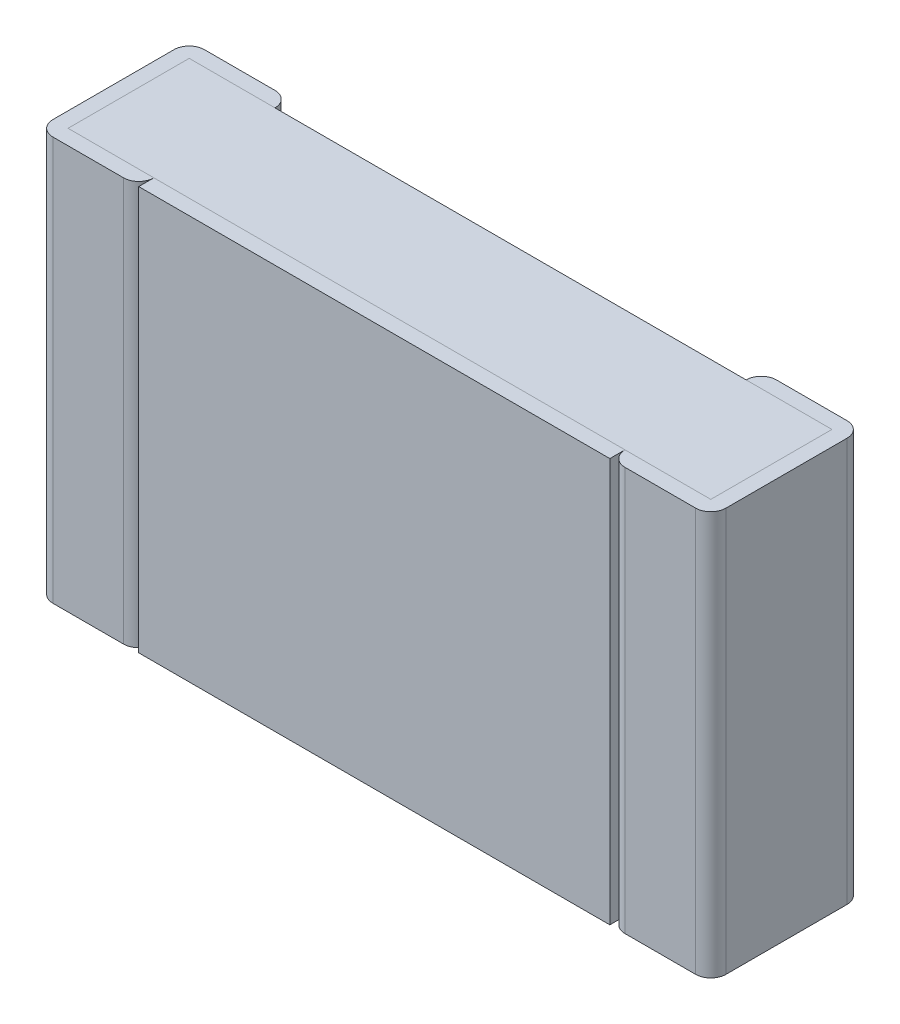
ISO-10303-21;
HEADER;
FILE_DESCRIPTION(('STEP AP214'),'2;1');
FILE_NAME('part.step','',(''),(''),'','','');
FILE_SCHEMA(('AUTOMOTIVE_DESIGN { 1 0 10303 214 1 1 1 1 }'));
ENDSEC;
DATA;
#1=APPLICATION_CONTEXT('core data for automotive mechanical design processes');
#2=APPLICATION_PROTOCOL_DEFINITION('international standard','automotive_design',2000,#1);
#3=PRODUCT_CONTEXT('',#1,'mechanical');
#4=PRODUCT('Part','Part','',(#3));
#5=PRODUCT_RELATED_PRODUCT_CATEGORY('part','',(#4));
#6=PRODUCT_DEFINITION_FORMATION('','',#4);
#7=PRODUCT_DEFINITION_CONTEXT('part definition',#1,'design');
#8=PRODUCT_DEFINITION('design','',#6,#7);
#9=PRODUCT_DEFINITION_SHAPE('','',#8);
#10=(LENGTH_UNIT() NAMED_UNIT(*) SI_UNIT(.MILLI.,.METRE.));
#11=(NAMED_UNIT(*) PLANE_ANGLE_UNIT() SI_UNIT($,.RADIAN.));
#12=(NAMED_UNIT(*) SI_UNIT($,.STERADIAN.) SOLID_ANGLE_UNIT());
#13=UNCERTAINTY_MEASURE_WITH_UNIT(LENGTH_MEASURE(1.E-05),#10,'distance_accuracy_value','');
#14=(GEOMETRIC_REPRESENTATION_CONTEXT(3) GLOBAL_UNCERTAINTY_ASSIGNED_CONTEXT((#13)) GLOBAL_UNIT_ASSIGNED_CONTEXT((#10,
#11,#12)) REPRESENTATION_CONTEXT('',''));
#15=CARTESIAN_POINT('',(0.,0.,0.));
#16=DIRECTION('',(0.,0.,1.));
#17=DIRECTION('',(1.,0.,0.));
#18=AXIS2_PLACEMENT_3D('',#15,#16,#17);
#19=CARTESIAN_POINT('',(-1.,-0.6,0.));
#20=DIRECTION('',(1.,0.,0.));
#21=DIRECTION('',(0.,1.,0.));
#22=AXIS2_PLACEMENT_3D('',#19,#20,#21);
#23=PLANE('',#22);
#24=DIRECTION('',(0.,1.,0.));
#25=VECTOR('',#24,1.);
#26=CARTESIAN_POINT('',(-1.,-0.6,0.405));
#27=LINE('',#26,#25);
#28=CARTESIAN_POINT('',(-1.,-0.6,0.405));
#29=VERTEX_POINT('',#28);
#30=CARTESIAN_POINT('',(-1.,0.6,0.405));
#31=VERTEX_POINT('',#30);
#32=EDGE_CURVE('E11',#29,#31,#27,.T.);
#33=ORIENTED_EDGE('',*,*,#32,.T.);
#34=DIRECTION('',(0.,0.,1.));
#35=VECTOR('',#34,1.);
#36=CARTESIAN_POINT('',(-1.,0.6,0.));
#37=LINE('',#36,#35);
#38=CARTESIAN_POINT('',(-1.,0.6,0.045));
#39=VERTEX_POINT('',#38);
#40=EDGE_CURVE('E41',#39,#31,#37,.T.);
#41=ORIENTED_EDGE('',*,*,#40,.F.);
#42=DIRECTION('',(0.,1.,0.));
#43=VECTOR('',#42,1.);
#44=CARTESIAN_POINT('',(-1.,-0.6,0.045));
#45=LINE('',#44,#43);
#46=CARTESIAN_POINT('',(-1.,-0.6,0.045));
#47=VERTEX_POINT('',#46);
#48=EDGE_CURVE('E331',#47,#39,#45,.T.);
#49=ORIENTED_EDGE('',*,*,#48,.F.);
#50=DIRECTION('',(0.,0.,1.));
#51=VECTOR('',#50,1.);
#52=CARTESIAN_POINT('',(-1.,-0.6,0.));
#53=LINE('',#52,#51);
#54=EDGE_CURVE('E27',#47,#29,#53,.T.);
#55=ORIENTED_EDGE('',*,*,#54,.T.);
#56=EDGE_LOOP('',(#33,#41,#49,#55));
#57=FACE_BOUND('',#56,.T.);
#58=ADVANCED_FACE('F16',(#57),#23,.F.);
#59=CARTESIAN_POINT('',(-1.,-0.6,0.));
#60=DIRECTION('',(0.,1.,0.));
#61=DIRECTION('',(1.,0.,0.));
#62=AXIS2_PLACEMENT_3D('',#59,#60,#61);
#63=PLANE('',#62);
#64=CARTESIAN_POINT('',(-0.745,-0.6,0.045));
#65=DIRECTION('',(0.,1.,0.));
#66=DIRECTION('',(0.,0.,1.));
#67=AXIS2_PLACEMENT_3D('',#64,#65,#66);
#68=CIRCLE('',#67,0.045);
#69=CARTESIAN_POINT('',(-0.7,-0.6,0.045));
#70=VERTEX_POINT('',#69);
#71=CARTESIAN_POINT('',(-0.745,-0.6,0.));
#72=VERTEX_POINT('',#71);
#73=EDGE_CURVE('E225',#70,#72,#68,.T.);
#74=ORIENTED_EDGE('',*,*,#73,.F.);
#75=DIRECTION('',(1.,0.,0.));
#76=VECTOR('',#75,1.);
#77=CARTESIAN_POINT('',(-0.955,-0.6,0.045));
#78=LINE('',#77,#76);
#79=CARTESIAN_POINT('',(-0.955,-0.6,0.045));
#80=VERTEX_POINT('',#79);
#81=EDGE_CURVE('E330',#80,#70,#78,.T.);
#82=ORIENTED_EDGE('',*,*,#81,.F.);
#83=DIRECTION('',(0.,0.,1.));
#84=VECTOR('',#83,1.);
#85=CARTESIAN_POINT('',(-0.955,-0.6,0.045));
#86=LINE('',#85,#84);
#87=CARTESIAN_POINT('',(-0.955,-0.6,0.405));
#88=VERTEX_POINT('',#87);
#89=EDGE_CURVE('E357',#80,#88,#86,.T.);
#90=ORIENTED_EDGE('',*,*,#89,.T.);
#91=DIRECTION('',(1.,0.,0.));
#92=VECTOR('',#91,1.);
#93=CARTESIAN_POINT('',(-0.955,-0.6,0.405));
#94=LINE('',#93,#92);
#95=CARTESIAN_POINT('',(-0.7,-0.6,0.405));
#96=VERTEX_POINT('',#95);
#97=EDGE_CURVE('E352',#88,#96,#94,.T.);
#98=ORIENTED_EDGE('',*,*,#97,.T.);
#99=CARTESIAN_POINT('',(-0.745,-0.6,0.405));
#100=DIRECTION('',(0.,-1.,0.));
#101=DIRECTION('',(0.,0.,1.));
#102=AXIS2_PLACEMENT_3D('',#99,#100,#101);
#103=CIRCLE('',#102,0.045);
#104=CARTESIAN_POINT('',(-0.745,-0.6,0.45));
#105=VERTEX_POINT('',#104);
#106=EDGE_CURVE('E348',#96,#105,#103,.T.);
#107=ORIENTED_EDGE('',*,*,#106,.T.);
#108=DIRECTION('',(1.,0.,0.));
#109=VECTOR('',#108,1.);
#110=CARTESIAN_POINT('',(-1.,-0.6,0.45));
#111=LINE('',#110,#109);
#112=CARTESIAN_POINT('',(-0.955,-0.6,0.45));
#113=VERTEX_POINT('',#112);
#114=EDGE_CURVE('E360',#113,#105,#111,.T.);
#115=ORIENTED_EDGE('',*,*,#114,.F.);
#116=CARTESIAN_POINT('',(-0.955,-0.6,0.405));
#117=DIRECTION('',(0.,1.,0.));
#118=DIRECTION('',(0.,0.,1.));
#119=AXIS2_PLACEMENT_3D('',#116,#117,#118);
#120=CIRCLE('',#119,0.045);
#121=EDGE_CURVE('E305',#29,#113,#120,.T.);
#122=ORIENTED_EDGE('',*,*,#121,.F.);
#123=ORIENTED_EDGE('',*,*,#54,.F.);
#124=CARTESIAN_POINT('',(-0.955,-0.6,0.045));
#125=DIRECTION('',(0.,-1.,0.));
#126=DIRECTION('',(0.,0.,1.));
#127=AXIS2_PLACEMENT_3D('',#124,#125,#126);
#128=CIRCLE('',#127,0.045);
#129=CARTESIAN_POINT('',(-0.955,-0.6,0.));
#130=VERTEX_POINT('',#129);
#131=EDGE_CURVE('E353',#47,#130,#128,.T.);
#132=ORIENTED_EDGE('',*,*,#131,.T.);
#133=DIRECTION('',(1.,0.,0.));
#134=VECTOR('',#133,1.);
#135=CARTESIAN_POINT('',(-1.,-0.6,0.));
#136=LINE('',#135,#134);
#137=EDGE_CURVE('E335',#130,#72,#136,.T.);
#138=ORIENTED_EDGE('',*,*,#137,.T.);
#139=EDGE_LOOP('',(#74,#82,#90,#98,#107,#115,#122,#123,#132,#138));
#140=FACE_BOUND('',#139,.T.);
#141=ADVANCED_FACE('F636',(#140),#63,.F.);
#142=CARTESIAN_POINT('',(-0.955,-0.6,0.045));
#143=DIRECTION('',(0.,1.,0.));
#144=DIRECTION('',(-1.,0.,0.));
#145=AXIS2_PLACEMENT_3D('',#142,#143,#144);
#146=CYLINDRICAL_SURFACE('',#145,0.045);
#147=ORIENTED_EDGE('',*,*,#48,.T.);
#148=CARTESIAN_POINT('',(-0.955,0.6,0.045));
#149=DIRECTION('',(0.,-1.,0.));
#150=DIRECTION('',(0.,0.,1.));
#151=AXIS2_PLACEMENT_3D('',#148,#149,#150);
#152=CIRCLE('',#151,0.045);
#153=CARTESIAN_POINT('',(-0.955,0.6,0.));
#154=VERTEX_POINT('',#153);
#155=EDGE_CURVE('E309',#39,#154,#152,.T.);
#156=ORIENTED_EDGE('',*,*,#155,.T.);
#157=DIRECTION('',(0.,1.,0.));
#158=VECTOR('',#157,1.);
#159=CARTESIAN_POINT('',(-0.955,-0.6,0.));
#160=LINE('',#159,#158);
#161=EDGE_CURVE('E222',#130,#154,#160,.T.);
#162=ORIENTED_EDGE('',*,*,#161,.F.);
#163=ORIENTED_EDGE('',*,*,#131,.F.);
#164=EDGE_LOOP('',(#147,#156,#162,#163));
#165=FACE_BOUND('',#164,.T.);
#166=ADVANCED_FACE('F618',(#165),#146,.T.);
#167=CARTESIAN_POINT('',(-0.955,-0.6,0.405));
#168=DIRECTION('',(0.,1.,0.));
#169=DIRECTION('',(-1.,0.,0.));
#170=AXIS2_PLACEMENT_3D('',#167,#168,#169);
#171=CYLINDRICAL_SURFACE('',#170,0.045);
#172=ORIENTED_EDGE('',*,*,#121,.T.);
#173=DIRECTION('',(0.,1.,0.));
#174=VECTOR('',#173,1.);
#175=CARTESIAN_POINT('',(-0.955,-0.6,0.45));
#176=LINE('',#175,#174);
#177=CARTESIAN_POINT('',(-0.955,0.6,0.45));
#178=VERTEX_POINT('',#177);
#179=EDGE_CURVE('E310',#113,#178,#176,.T.);
#180=ORIENTED_EDGE('',*,*,#179,.T.);
#181=CARTESIAN_POINT('',(-0.955,0.6,0.405));
#182=DIRECTION('',(0.,1.,0.));
#183=DIRECTION('',(0.,0.,1.));
#184=AXIS2_PLACEMENT_3D('',#181,#182,#183);
#185=CIRCLE('',#184,0.045);
#186=EDGE_CURVE('E364',#31,#178,#185,.T.);
#187=ORIENTED_EDGE('',*,*,#186,.F.);
#188=ORIENTED_EDGE('',*,*,#32,.F.);
#189=EDGE_LOOP('',(#172,#180,#187,#188));
#190=FACE_BOUND('',#189,.T.);
#191=ADVANCED_FACE('F540',(#190),#171,.T.);
#192=CARTESIAN_POINT('',(-1.,0.6,0.));
#193=DIRECTION('',(0.,1.,0.));
#194=DIRECTION('',(1.,0.,0.));
#195=AXIS2_PLACEMENT_3D('',#192,#193,#194);
#196=PLANE('',#195);
#197=DIRECTION('',(1.,0.,0.));
#198=VECTOR('',#197,1.);
#199=CARTESIAN_POINT('',(-1.,0.6,0.));
#200=LINE('',#199,#198);
#201=CARTESIAN_POINT('',(-0.745,0.6,0.));
#202=VERTEX_POINT('',#201);
#203=EDGE_CURVE('E216',#154,#202,#200,.T.);
#204=ORIENTED_EDGE('',*,*,#203,.F.);
#205=ORIENTED_EDGE('',*,*,#155,.F.);
#206=ORIENTED_EDGE('',*,*,#40,.T.);
#207=ORIENTED_EDGE('',*,*,#186,.T.);
#208=DIRECTION('',(1.,0.,0.));
#209=VECTOR('',#208,1.);
#210=CARTESIAN_POINT('',(-1.,0.6,0.45));
#211=LINE('',#210,#209);
#212=CARTESIAN_POINT('',(-0.745,0.6,0.45));
#213=VERTEX_POINT('',#212);
#214=EDGE_CURVE('E299',#178,#213,#211,.T.);
#215=ORIENTED_EDGE('',*,*,#214,.T.);
#216=CARTESIAN_POINT('',(-0.745,0.6,0.405));
#217=DIRECTION('',(0.,-1.,0.));
#218=DIRECTION('',(0.,0.,1.));
#219=AXIS2_PLACEMENT_3D('',#216,#217,#218);
#220=CIRCLE('',#219,0.045);
#221=CARTESIAN_POINT('',(-0.7,0.6,0.405));
#222=VERTEX_POINT('',#221);
#223=EDGE_CURVE('E392',#222,#213,#220,.T.);
#224=ORIENTED_EDGE('',*,*,#223,.F.);
#225=DIRECTION('',(1.,0.,0.));
#226=VECTOR('',#225,1.);
#227=CARTESIAN_POINT('',(-0.955,0.6,0.405));
#228=LINE('',#227,#226);
#229=CARTESIAN_POINT('',(-0.955,0.6,0.405));
#230=VERTEX_POINT('',#229);
#231=EDGE_CURVE('E323',#230,#222,#228,.T.);
#232=ORIENTED_EDGE('',*,*,#231,.F.);
#233=DIRECTION('',(0.,0.,1.));
#234=VECTOR('',#233,1.);
#235=CARTESIAN_POINT('',(-0.955,0.6,0.045));
#236=LINE('',#235,#234);
#237=CARTESIAN_POINT('',(-0.955,0.6,0.045));
#238=VERTEX_POINT('',#237);
#239=EDGE_CURVE('E326',#238,#230,#236,.T.);
#240=ORIENTED_EDGE('',*,*,#239,.F.);
#241=DIRECTION('',(1.,0.,0.));
#242=VECTOR('',#241,1.);
#243=CARTESIAN_POINT('',(-0.955,0.6,0.045));
#244=LINE('',#243,#242);
#245=CARTESIAN_POINT('',(-0.7,0.6,0.045));
#246=VERTEX_POINT('',#245);
#247=EDGE_CURVE('E232',#238,#246,#244,.T.);
#248=ORIENTED_EDGE('',*,*,#247,.T.);
#249=CARTESIAN_POINT('',(-0.745,0.6,0.045));
#250=DIRECTION('',(0.,1.,0.));
#251=DIRECTION('',(0.,0.,1.));
#252=AXIS2_PLACEMENT_3D('',#249,#250,#251);
#253=CIRCLE('',#252,0.045);
#254=EDGE_CURVE('E229',#246,#202,#253,.T.);
#255=ORIENTED_EDGE('',*,*,#254,.T.);
#256=EDGE_LOOP('',(#204,#205,#206,#207,#215,#224,#232,#240,#248,#255));
#257=FACE_BOUND('',#256,.T.);
#258=ADVANCED_FACE('F230',(#257),#196,.T.);
#259=CARTESIAN_POINT('',(-1.,-0.6,0.));
#260=DIRECTION('',(0.,0.,1.));
#261=DIRECTION('',(1.,0.,0.));
#262=AXIS2_PLACEMENT_3D('',#259,#260,#261);
#263=PLANE('',#262);
#264=DIRECTION('',(0.,1.,0.));
#265=VECTOR('',#264,1.);
#266=CARTESIAN_POINT('',(-0.745,-0.6,0.));
#267=LINE('',#266,#265);
#268=EDGE_CURVE('E220',#72,#202,#267,.T.);
#269=ORIENTED_EDGE('',*,*,#268,.F.);
#270=ORIENTED_EDGE('',*,*,#137,.F.);
#271=ORIENTED_EDGE('',*,*,#161,.T.);
#272=ORIENTED_EDGE('',*,*,#203,.T.);
#273=EDGE_LOOP('',(#269,#270,#271,#272));
#274=FACE_BOUND('',#273,.T.);
#275=ADVANCED_FACE('F218',(#274),#263,.F.);
#276=CARTESIAN_POINT('',(-0.745,-0.6,0.045));
#277=DIRECTION('',(0.,1.,0.));
#278=DIRECTION('',(1.,0.,0.));
#279=AXIS2_PLACEMENT_3D('',#276,#277,#278);
#280=CYLINDRICAL_SURFACE('',#279,0.045);
#281=ORIENTED_EDGE('',*,*,#73,.T.);
#282=ORIENTED_EDGE('',*,*,#268,.T.);
#283=ORIENTED_EDGE('',*,*,#254,.F.);
#284=DIRECTION('',(0.,1.,0.));
#285=VECTOR('',#284,1.);
#286=CARTESIAN_POINT('',(-0.7,-0.6,0.045));
#287=LINE('',#286,#285);
#288=EDGE_CURVE('E266',#70,#246,#287,.T.);
#289=ORIENTED_EDGE('',*,*,#288,.F.);
#290=EDGE_LOOP('',(#281,#282,#283,#289));
#291=FACE_BOUND('',#290,.T.);
#292=ADVANCED_FACE('F237',(#291),#280,.T.);
#293=CARTESIAN_POINT('',(-0.955,-0.6,0.045));
#294=DIRECTION('',(0.,1.,0.));
#295=DIRECTION('',(1.,0.,0.));
#296=AXIS2_PLACEMENT_3D('',#293,#294,#295);
#297=PLANE('',#296);
#298=DIRECTION('',(1.,0.,0.));
#299=VECTOR('',#298,1.);
#300=CARTESIAN_POINT('',(-0.955,-0.6,0.045));
#301=LINE('',#300,#299);
#302=CARTESIAN_POINT('',(0.7,-0.6,0.045));
#303=VERTEX_POINT('',#302);
#304=EDGE_CURVE('E241',#70,#303,#301,.T.);
#305=ORIENTED_EDGE('',*,*,#304,.T.);
#306=DIRECTION('',(1.,0.,0.));
#307=VECTOR('',#306,1.);
#308=CARTESIAN_POINT('',(-0.955,-0.6,0.045));
#309=LINE('',#308,#307);
#310=CARTESIAN_POINT('',(0.955,-0.6,0.045));
#311=VERTEX_POINT('',#310);
#312=EDGE_CURVE('E250',#303,#311,#309,.T.);
#313=ORIENTED_EDGE('',*,*,#312,.T.);
#314=DIRECTION('',(0.,0.,1.));
#315=VECTOR('',#314,1.);
#316=CARTESIAN_POINT('',(0.955,-0.6,0.045));
#317=LINE('',#316,#315);
#318=CARTESIAN_POINT('',(0.955,-0.6,0.405));
#319=VERTEX_POINT('',#318);
#320=EDGE_CURVE('E256',#311,#319,#317,.T.);
#321=ORIENTED_EDGE('',*,*,#320,.T.);
#322=DIRECTION('',(1.,0.,0.));
#323=VECTOR('',#322,1.);
#324=CARTESIAN_POINT('',(-0.955,-0.6,0.405));
#325=LINE('',#324,#323);
#326=CARTESIAN_POINT('',(0.7,-0.6,0.405));
#327=VERTEX_POINT('',#326);
#328=EDGE_CURVE('E296',#327,#319,#325,.T.);
#329=ORIENTED_EDGE('',*,*,#328,.F.);
#330=DIRECTION('',(1.,0.,0.));
#331=VECTOR('',#330,1.);
#332=CARTESIAN_POINT('',(-0.7,-0.6,0.405));
#333=LINE('',#332,#331);
#334=EDGE_CURVE('E346',#96,#327,#333,.T.);
#335=ORIENTED_EDGE('',*,*,#334,.F.);
#336=ORIENTED_EDGE('',*,*,#97,.F.);
#337=ORIENTED_EDGE('',*,*,#89,.F.);
#338=ORIENTED_EDGE('',*,*,#81,.T.);
#339=EDGE_LOOP('',(#305,#313,#321,#329,#335,#336,#337,#338));
#340=FACE_BOUND('',#339,.T.);
#341=ADVANCED_FACE('F568',(#340),#297,.F.);
#342=CARTESIAN_POINT('',(-1.,-0.6,0.45));
#343=DIRECTION('',(0.,0.,1.));
#344=DIRECTION('',(1.,0.,0.));
#345=AXIS2_PLACEMENT_3D('',#342,#343,#344);
#346=PLANE('',#345);
#347=ORIENTED_EDGE('',*,*,#214,.F.);
#348=ORIENTED_EDGE('',*,*,#179,.F.);
#349=ORIENTED_EDGE('',*,*,#114,.T.);
#350=DIRECTION('',(0.,1.,0.));
#351=VECTOR('',#350,1.);
#352=CARTESIAN_POINT('',(-0.745,-0.6,0.45));
#353=LINE('',#352,#351);
#354=EDGE_CURVE('E363',#105,#213,#353,.T.);
#355=ORIENTED_EDGE('',*,*,#354,.T.);
#356=EDGE_LOOP('',(#347,#348,#349,#355));
#357=FACE_BOUND('',#356,.T.);
#358=ADVANCED_FACE('F559',(#357),#346,.T.);
#359=CARTESIAN_POINT('',(-0.745,-0.6,0.405));
#360=DIRECTION('',(0.,1.,0.));
#361=DIRECTION('',(1.,0.,0.));
#362=AXIS2_PLACEMENT_3D('',#359,#360,#361);
#363=CYLINDRICAL_SURFACE('',#362,0.045);
#364=DIRECTION('',(0.,1.,0.));
#365=VECTOR('',#364,1.);
#366=CARTESIAN_POINT('',(-0.7,-0.6,0.405));
#367=LINE('',#366,#365);
#368=EDGE_CURVE('E381',#96,#222,#367,.T.);
#369=ORIENTED_EDGE('',*,*,#368,.T.);
#370=ORIENTED_EDGE('',*,*,#223,.T.);
#371=ORIENTED_EDGE('',*,*,#354,.F.);
#372=ORIENTED_EDGE('',*,*,#106,.F.);
#373=EDGE_LOOP('',(#369,#370,#371,#372));
#374=FACE_BOUND('',#373,.T.);
#375=ADVANCED_FACE('F555',(#374),#363,.T.);
#376=CARTESIAN_POINT('',(-0.955,0.6,0.045));
#377=DIRECTION('',(0.,1.,0.));
#378=DIRECTION('',(1.,0.,0.));
#379=AXIS2_PLACEMENT_3D('',#376,#377,#378);
#380=PLANE('',#379);
#381=ORIENTED_EDGE('',*,*,#247,.F.);
#382=ORIENTED_EDGE('',*,*,#239,.T.);
#383=ORIENTED_EDGE('',*,*,#231,.T.);
#384=DIRECTION('',(1.,0.,0.));
#385=VECTOR('',#384,1.);
#386=CARTESIAN_POINT('',(-0.7,0.6,0.405));
#387=LINE('',#386,#385);
#388=CARTESIAN_POINT('',(0.7,0.6,0.405));
#389=VERTEX_POINT('',#388);
#390=EDGE_CURVE('E277',#222,#389,#387,.T.);
#391=ORIENTED_EDGE('',*,*,#390,.T.);
#392=DIRECTION('',(1.,0.,0.));
#393=VECTOR('',#392,1.);
#394=CARTESIAN_POINT('',(-0.955,0.6,0.405));
#395=LINE('',#394,#393);
#396=CARTESIAN_POINT('',(0.955,0.6,0.405));
#397=VERTEX_POINT('',#396);
#398=EDGE_CURVE('E271',#389,#397,#395,.T.);
#399=ORIENTED_EDGE('',*,*,#398,.T.);
#400=DIRECTION('',(0.,0.,1.));
#401=VECTOR('',#400,1.);
#402=CARTESIAN_POINT('',(0.955,0.6,0.045));
#403=LINE('',#402,#401);
#404=CARTESIAN_POINT('',(0.955,0.6,0.045));
#405=VERTEX_POINT('',#404);
#406=EDGE_CURVE('E257',#405,#397,#403,.T.);
#407=ORIENTED_EDGE('',*,*,#406,.F.);
#408=DIRECTION('',(1.,0.,0.));
#409=VECTOR('',#408,1.);
#410=CARTESIAN_POINT('',(-0.955,0.6,0.045));
#411=LINE('',#410,#409);
#412=CARTESIAN_POINT('',(0.7,0.6,0.045));
#413=VERTEX_POINT('',#412);
#414=EDGE_CURVE('E261',#413,#405,#411,.T.);
#415=ORIENTED_EDGE('',*,*,#414,.F.);
#416=DIRECTION('',(1.,0.,0.));
#417=VECTOR('',#416,1.);
#418=CARTESIAN_POINT('',(-0.955,0.6,0.045));
#419=LINE('',#418,#417);
#420=EDGE_CURVE('E268',#246,#413,#419,.T.);
#421=ORIENTED_EDGE('',*,*,#420,.F.);
#422=EDGE_LOOP('',(#381,#382,#383,#391,#399,#407,#415,#421));
#423=FACE_BOUND('',#422,.T.);
#424=ADVANCED_FACE('F520',(#423),#380,.T.);
#425=CARTESIAN_POINT('',(-0.955,-0.6,0.045));
#426=DIRECTION('',(0.,0.,1.));
#427=DIRECTION('',(1.,0.,0.));
#428=AXIS2_PLACEMENT_3D('',#425,#426,#427);
#429=PLANE('',#428);
#430=ORIENTED_EDGE('',*,*,#420,.T.);
#431=DIRECTION('',(0.,1.,0.));
#432=VECTOR('',#431,1.);
#433=CARTESIAN_POINT('',(0.7,-0.6,0.045));
#434=LINE('',#433,#432);
#435=EDGE_CURVE('E386',#303,#413,#434,.T.);
#436=ORIENTED_EDGE('',*,*,#435,.F.);
#437=ORIENTED_EDGE('',*,*,#304,.F.);
#438=ORIENTED_EDGE('',*,*,#288,.T.);
#439=EDGE_LOOP('',(#430,#436,#437,#438));
#440=FACE_BOUND('',#439,.T.);
#441=ADVANCED_FACE('F509',(#440),#429,.F.);
#442=CARTESIAN_POINT('',(0.7,-0.6,0.));
#443=DIRECTION('',(0.,1.,0.));
#444=DIRECTION('',(1.,0.,0.));
#445=AXIS2_PLACEMENT_3D('',#442,#443,#444);
#446=PLANE('',#445);
#447=CARTESIAN_POINT('',(0.955,-0.6,0.045));
#448=DIRECTION('',(0.,1.,0.));
#449=DIRECTION('',(0.,0.,1.));
#450=AXIS2_PLACEMENT_3D('',#447,#448,#449);
#451=CIRCLE('',#450,0.045);
#452=CARTESIAN_POINT('',(1.,-0.6,0.045));
#453=VERTEX_POINT('',#452);
#454=CARTESIAN_POINT('',(0.955,-0.6,0.));
#455=VERTEX_POINT('',#454);
#456=EDGE_CURVE('E20',#453,#455,#451,.T.);
#457=ORIENTED_EDGE('',*,*,#456,.F.);
#458=DIRECTION('',(0.,0.,1.));
#459=VECTOR('',#458,1.);
#460=CARTESIAN_POINT('',(1.,-0.6,0.));
#461=LINE('',#460,#459);
#462=CARTESIAN_POINT('',(1.,-0.6,0.405));
#463=VERTEX_POINT('',#462);
#464=EDGE_CURVE('E263',#453,#463,#461,.T.);
#465=ORIENTED_EDGE('',*,*,#464,.T.);
#466=CARTESIAN_POINT('',(0.955,-0.6,0.405));
#467=DIRECTION('',(0.,-1.,0.));
#468=DIRECTION('',(0.,0.,1.));
#469=AXIS2_PLACEMENT_3D('',#466,#467,#468);
#470=CIRCLE('',#469,0.045);
#471=CARTESIAN_POINT('',(0.955,-0.6,0.45));
#472=VERTEX_POINT('',#471);
#473=EDGE_CURVE('E267',#463,#472,#470,.T.);
#474=ORIENTED_EDGE('',*,*,#473,.T.);
#475=DIRECTION('',(1.,0.,0.));
#476=VECTOR('',#475,1.);
#477=CARTESIAN_POINT('',(0.7,-0.6,0.45));
#478=LINE('',#477,#476);
#479=CARTESIAN_POINT('',(0.745,-0.6,0.45));
#480=VERTEX_POINT('',#479);
#481=EDGE_CURVE('E321',#480,#472,#478,.T.);
#482=ORIENTED_EDGE('',*,*,#481,.F.);
#483=CARTESIAN_POINT('',(0.745,-0.6,0.405));
#484=DIRECTION('',(0.,1.,0.));
#485=DIRECTION('',(0.,0.,1.));
#486=AXIS2_PLACEMENT_3D('',#483,#484,#485);
#487=CIRCLE('',#486,0.045);
#488=EDGE_CURVE('E322',#327,#480,#487,.T.);
#489=ORIENTED_EDGE('',*,*,#488,.F.);
#490=ORIENTED_EDGE('',*,*,#328,.T.);
#491=ORIENTED_EDGE('',*,*,#320,.F.);
#492=ORIENTED_EDGE('',*,*,#312,.F.);
#493=CARTESIAN_POINT('',(0.745,-0.6,0.045));
#494=DIRECTION('',(0.,-1.,0.));
#495=DIRECTION('',(0.,0.,1.));
#496=AXIS2_PLACEMENT_3D('',#493,#494,#495);
#497=CIRCLE('',#496,0.045);
#498=CARTESIAN_POINT('',(0.745,-0.6,0.));
#499=VERTEX_POINT('',#498);
#500=EDGE_CURVE('E300',#303,#499,#497,.T.);
#501=ORIENTED_EDGE('',*,*,#500,.T.);
#502=DIRECTION('',(1.,0.,0.));
#503=VECTOR('',#502,1.);
#504=CARTESIAN_POINT('',(0.7,-0.6,0.));
#505=LINE('',#504,#503);
#506=EDGE_CURVE('E304',#499,#455,#505,.T.);
#507=ORIENTED_EDGE('',*,*,#506,.T.);
#508=EDGE_LOOP('',(#457,#465,#474,#482,#489,#490,#491,#492,#501,#507));
#509=FACE_BOUND('',#508,.T.);
#510=ADVANCED_FACE('F18',(#509),#446,.F.);
#511=CARTESIAN_POINT('',(-0.7,-0.6,0.405));
#512=DIRECTION('',(0.,1.,0.));
#513=DIRECTION('',(1.,0.,0.));
#514=AXIS2_PLACEMENT_3D('',#511,#512,#513);
#515=PLANE('',#514);
#516=DIRECTION('',(0.,0.,1.));
#517=VECTOR('',#516,1.);
#518=CARTESIAN_POINT('',(0.7,-0.6,0.405));
#519=LINE('',#518,#517);
#520=CARTESIAN_POINT('',(0.7,-0.6,0.45));
#521=VERTEX_POINT('',#520);
#522=EDGE_CURVE('E405',#327,#521,#519,.T.);
#523=ORIENTED_EDGE('',*,*,#522,.T.);
#524=DIRECTION('',(1.,0.,0.));
#525=VECTOR('',#524,1.);
#526=CARTESIAN_POINT('',(-0.7,-0.6,0.45));
#527=LINE('',#526,#525);
#528=CARTESIAN_POINT('',(-0.7,-0.6,0.45));
#529=VERTEX_POINT('',#528);
#530=EDGE_CURVE('E287',#529,#521,#527,.T.);
#531=ORIENTED_EDGE('',*,*,#530,.F.);
#532=DIRECTION('',(0.,0.,1.));
#533=VECTOR('',#532,1.);
#534=CARTESIAN_POINT('',(-0.7,-0.6,0.405));
#535=LINE('',#534,#533);
#536=EDGE_CURVE('E347',#96,#529,#535,.T.);
#537=ORIENTED_EDGE('',*,*,#536,.F.);
#538=ORIENTED_EDGE('',*,*,#334,.T.);
#539=EDGE_LOOP('',(#523,#531,#537,#538));
#540=FACE_BOUND('',#539,.T.);
#541=ADVANCED_FACE('F508',(#540),#515,.F.);
#542=CARTESIAN_POINT('',(-0.7,-0.6,0.405));
#543=DIRECTION('',(1.,0.,0.));
#544=DIRECTION('',(0.,1.,0.));
#545=AXIS2_PLACEMENT_3D('',#542,#543,#544);
#546=PLANE('',#545);
#547=DIRECTION('',(0.,1.,0.));
#548=VECTOR('',#547,1.);
#549=CARTESIAN_POINT('',(-0.7,-0.6,0.45));
#550=LINE('',#549,#548);
#551=CARTESIAN_POINT('',(-0.7,0.6,0.45));
#552=VERTEX_POINT('',#551);
#553=EDGE_CURVE('E342',#529,#552,#550,.T.);
#554=ORIENTED_EDGE('',*,*,#553,.T.);
#555=DIRECTION('',(0.,0.,1.));
#556=VECTOR('',#555,1.);
#557=CARTESIAN_POINT('',(-0.7,0.6,0.405));
#558=LINE('',#557,#556);
#559=EDGE_CURVE('E289',#222,#552,#558,.T.);
#560=ORIENTED_EDGE('',*,*,#559,.F.);
#561=ORIENTED_EDGE('',*,*,#368,.F.);
#562=ORIENTED_EDGE('',*,*,#536,.T.);
#563=EDGE_LOOP('',(#554,#560,#561,#562));
#564=FACE_BOUND('',#563,.T.);
#565=ADVANCED_FACE('F549',(#564),#546,.F.);
#566=CARTESIAN_POINT('',(0.7,0.6,0.));
#567=DIRECTION('',(0.,1.,0.));
#568=DIRECTION('',(1.,0.,0.));
#569=AXIS2_PLACEMENT_3D('',#566,#567,#568);
#570=PLANE('',#569);
#571=DIRECTION('',(1.,0.,0.));
#572=VECTOR('',#571,1.);
#573=CARTESIAN_POINT('',(0.7,0.6,0.));
#574=LINE('',#573,#572);
#575=CARTESIAN_POINT('',(0.745,0.6,0.));
#576=VERTEX_POINT('',#575);
#577=CARTESIAN_POINT('',(0.955,0.6,0.));
#578=VERTEX_POINT('',#577);
#579=EDGE_CURVE('E112',#576,#578,#574,.T.);
#580=ORIENTED_EDGE('',*,*,#579,.F.);
#581=CARTESIAN_POINT('',(0.745,0.6,0.045));
#582=DIRECTION('',(0.,-1.,0.));
#583=DIRECTION('',(0.,0.,1.));
#584=AXIS2_PLACEMENT_3D('',#581,#582,#583);
#585=CIRCLE('',#584,0.045);
#586=EDGE_CURVE('E374',#413,#576,#585,.T.);
#587=ORIENTED_EDGE('',*,*,#586,.F.);
#588=ORIENTED_EDGE('',*,*,#414,.T.);
#589=ORIENTED_EDGE('',*,*,#406,.T.);
#590=ORIENTED_EDGE('',*,*,#398,.F.);
#591=CARTESIAN_POINT('',(0.745,0.6,0.405));
#592=DIRECTION('',(0.,1.,0.));
#593=DIRECTION('',(0.,0.,1.));
#594=AXIS2_PLACEMENT_3D('',#591,#592,#593);
#595=CIRCLE('',#594,0.045);
#596=CARTESIAN_POINT('',(0.745,0.6,0.45));
#597=VERTEX_POINT('',#596);
#598=EDGE_CURVE('E262',#389,#597,#595,.T.);
#599=ORIENTED_EDGE('',*,*,#598,.T.);
#600=DIRECTION('',(1.,0.,0.));
#601=VECTOR('',#600,1.);
#602=CARTESIAN_POINT('',(0.7,0.6,0.45));
#603=LINE('',#602,#601);
#604=CARTESIAN_POINT('',(0.955,0.6,0.45));
#605=VERTEX_POINT('',#604);
#606=EDGE_CURVE('E396',#597,#605,#603,.T.);
#607=ORIENTED_EDGE('',*,*,#606,.T.);
#608=CARTESIAN_POINT('',(0.955,0.6,0.405));
#609=DIRECTION('',(0.,-1.,0.));
#610=DIRECTION('',(0.,0.,1.));
#611=AXIS2_PLACEMENT_3D('',#608,#609,#610);
#612=CIRCLE('',#611,0.045);
#613=CARTESIAN_POINT('',(1.,0.6,0.405));
#614=VERTEX_POINT('',#613);
#615=EDGE_CURVE('E316',#614,#605,#612,.T.);
#616=ORIENTED_EDGE('',*,*,#615,.F.);
#617=DIRECTION('',(0.,0.,1.));
#618=VECTOR('',#617,1.);
#619=CARTESIAN_POINT('',(1.,0.6,0.));
#620=LINE('',#619,#618);
#621=CARTESIAN_POINT('',(1.,0.6,0.045));
#622=VERTEX_POINT('',#621);
#623=EDGE_CURVE('E315',#622,#614,#620,.T.);
#624=ORIENTED_EDGE('',*,*,#623,.F.);
#625=CARTESIAN_POINT('',(0.955,0.6,0.045));
#626=DIRECTION('',(0.,1.,0.));
#627=DIRECTION('',(0.,0.,1.));
#628=AXIS2_PLACEMENT_3D('',#625,#626,#627);
#629=CIRCLE('',#628,0.045);
#630=EDGE_CURVE('E291',#622,#578,#629,.T.);
#631=ORIENTED_EDGE('',*,*,#630,.T.);
#632=EDGE_LOOP('',(#580,#587,#588,#589,#590,#599,#607,#616,#624,#631));
#633=FACE_BOUND('',#632,.T.);
#634=ADVANCED_FACE('F493',(#633),#570,.T.);
#635=CARTESIAN_POINT('',(-0.7,0.6,0.405));
#636=DIRECTION('',(0.,1.,0.));
#637=DIRECTION('',(1.,0.,0.));
#638=AXIS2_PLACEMENT_3D('',#635,#636,#637);
#639=PLANE('',#638);
#640=ORIENTED_EDGE('',*,*,#390,.F.);
#641=ORIENTED_EDGE('',*,*,#559,.T.);
#642=DIRECTION('',(1.,0.,0.));
#643=VECTOR('',#642,1.);
#644=CARTESIAN_POINT('',(-0.7,0.6,0.45));
#645=LINE('',#644,#643);
#646=CARTESIAN_POINT('',(0.7,0.6,0.45));
#647=VERTEX_POINT('',#646);
#648=EDGE_CURVE('E292',#552,#647,#645,.T.);
#649=ORIENTED_EDGE('',*,*,#648,.T.);
#650=DIRECTION('',(0.,0.,1.));
#651=VECTOR('',#650,1.);
#652=CARTESIAN_POINT('',(0.7,0.6,0.405));
#653=LINE('',#652,#651);
#654=EDGE_CURVE('E128',#389,#647,#653,.T.);
#655=ORIENTED_EDGE('',*,*,#654,.F.);
#656=EDGE_LOOP('',(#640,#641,#649,#655));
#657=FACE_BOUND('',#656,.T.);
#658=ADVANCED_FACE('F531',(#657),#639,.T.);
#659=CARTESIAN_POINT('',(0.745,-0.6,0.045));
#660=DIRECTION('',(0.,1.,0.));
#661=DIRECTION('',(-1.,0.,0.));
#662=AXIS2_PLACEMENT_3D('',#659,#660,#661);
#663=CYLINDRICAL_SURFACE('',#662,0.045);
#664=ORIENTED_EDGE('',*,*,#435,.T.);
#665=ORIENTED_EDGE('',*,*,#586,.T.);
#666=DIRECTION('',(0.,1.,0.));
#667=VECTOR('',#666,1.);
#668=CARTESIAN_POINT('',(0.745,-0.6,0.));
#669=LINE('',#668,#667);
#670=EDGE_CURVE('E371',#499,#576,#669,.T.);
#671=ORIENTED_EDGE('',*,*,#670,.F.);
#672=ORIENTED_EDGE('',*,*,#500,.F.);
#673=EDGE_LOOP('',(#664,#665,#671,#672));
#674=FACE_BOUND('',#673,.T.);
#675=ADVANCED_FACE('F526',(#674),#663,.T.);
#676=CARTESIAN_POINT('',(0.7,-0.6,0.));
#677=DIRECTION('',(0.,0.,1.));
#678=DIRECTION('',(1.,0.,0.));
#679=AXIS2_PLACEMENT_3D('',#676,#677,#678);
#680=PLANE('',#679);
#681=DIRECTION('',(0.,1.,0.));
#682=VECTOR('',#681,1.);
#683=CARTESIAN_POINT('',(0.955,-0.6,0.));
#684=LINE('',#683,#682);
#685=EDGE_CURVE('E407',#455,#578,#684,.T.);
#686=ORIENTED_EDGE('',*,*,#685,.F.);
#687=ORIENTED_EDGE('',*,*,#506,.F.);
#688=ORIENTED_EDGE('',*,*,#670,.T.);
#689=ORIENTED_EDGE('',*,*,#579,.T.);
#690=EDGE_LOOP('',(#686,#687,#688,#689));
#691=FACE_BOUND('',#690,.T.);
#692=ADVANCED_FACE('F530',(#691),#680,.F.);
#693=CARTESIAN_POINT('',(0.955,-0.6,0.045));
#694=DIRECTION('',(0.,1.,0.));
#695=DIRECTION('',(1.,0.,0.));
#696=AXIS2_PLACEMENT_3D('',#693,#694,#695);
#697=CYLINDRICAL_SURFACE('',#696,0.045);
#698=ORIENTED_EDGE('',*,*,#456,.T.);
#699=ORIENTED_EDGE('',*,*,#685,.T.);
#700=ORIENTED_EDGE('',*,*,#630,.F.);
#701=DIRECTION('',(0.,1.,0.));
#702=VECTOR('',#701,1.);
#703=CARTESIAN_POINT('',(1.,-0.6,0.045));
#704=LINE('',#703,#702);
#705=EDGE_CURVE('E411',#453,#622,#704,.T.);
#706=ORIENTED_EDGE('',*,*,#705,.F.);
#707=EDGE_LOOP('',(#698,#699,#700,#706));
#708=FACE_BOUND('',#707,.T.);
#709=ADVANCED_FACE('F491',(#708),#697,.T.);
#710=CARTESIAN_POINT('',(1.,-0.6,0.));
#711=DIRECTION('',(1.,0.,0.));
#712=DIRECTION('',(0.,1.,0.));
#713=AXIS2_PLACEMENT_3D('',#710,#711,#712);
#714=PLANE('',#713);
#715=ORIENTED_EDGE('',*,*,#464,.F.);
#716=ORIENTED_EDGE('',*,*,#705,.T.);
#717=ORIENTED_EDGE('',*,*,#623,.T.);
#718=DIRECTION('',(0.,1.,0.));
#719=VECTOR('',#718,1.);
#720=CARTESIAN_POINT('',(1.,-0.6,0.405));
#721=LINE('',#720,#719);
#722=EDGE_CURVE('E311',#463,#614,#721,.T.);
#723=ORIENTED_EDGE('',*,*,#722,.F.);
#724=EDGE_LOOP('',(#715,#716,#717,#723));
#725=FACE_BOUND('',#724,.T.);
#726=ADVANCED_FACE('F487',(#725),#714,.T.);
#727=CARTESIAN_POINT('',(0.955,-0.6,0.405));
#728=DIRECTION('',(0.,1.,0.));
#729=DIRECTION('',(1.,0.,0.));
#730=AXIS2_PLACEMENT_3D('',#727,#728,#729);
#731=CYLINDRICAL_SURFACE('',#730,0.045);
#732=ORIENTED_EDGE('',*,*,#722,.T.);
#733=ORIENTED_EDGE('',*,*,#615,.T.);
#734=DIRECTION('',(0.,1.,0.));
#735=VECTOR('',#734,1.);
#736=CARTESIAN_POINT('',(0.955,-0.6,0.45));
#737=LINE('',#736,#735);
#738=EDGE_CURVE('E317',#472,#605,#737,.T.);
#739=ORIENTED_EDGE('',*,*,#738,.F.);
#740=ORIENTED_EDGE('',*,*,#473,.F.);
#741=EDGE_LOOP('',(#732,#733,#739,#740));
#742=FACE_BOUND('',#741,.T.);
#743=ADVANCED_FACE('F496',(#742),#731,.T.);
#744=CARTESIAN_POINT('',(0.7,-0.6,0.45));
#745=DIRECTION('',(0.,0.,1.));
#746=DIRECTION('',(1.,0.,0.));
#747=AXIS2_PLACEMENT_3D('',#744,#745,#746);
#748=PLANE('',#747);
#749=ORIENTED_EDGE('',*,*,#606,.F.);
#750=DIRECTION('',(0.,1.,0.));
#751=VECTOR('',#750,1.);
#752=CARTESIAN_POINT('',(0.745,-0.6,0.45));
#753=LINE('',#752,#751);
#754=EDGE_CURVE('E339',#480,#597,#753,.T.);
#755=ORIENTED_EDGE('',*,*,#754,.F.);
#756=ORIENTED_EDGE('',*,*,#481,.T.);
#757=ORIENTED_EDGE('',*,*,#738,.T.);
#758=EDGE_LOOP('',(#749,#755,#756,#757));
#759=FACE_BOUND('',#758,.T.);
#760=ADVANCED_FACE('F597',(#759),#748,.T.);
#761=CARTESIAN_POINT('',(0.745,-0.6,0.405));
#762=DIRECTION('',(0.,1.,0.));
#763=DIRECTION('',(-1.,0.,0.));
#764=AXIS2_PLACEMENT_3D('',#761,#762,#763);
#765=CYLINDRICAL_SURFACE('',#764,0.045);
#766=ORIENTED_EDGE('',*,*,#488,.T.);
#767=ORIENTED_EDGE('',*,*,#754,.T.);
#768=ORIENTED_EDGE('',*,*,#598,.F.);
#769=DIRECTION('',(0.,1.,0.));
#770=VECTOR('',#769,1.);
#771=CARTESIAN_POINT('',(0.7,-0.6,0.405));
#772=LINE('',#771,#770);
#773=EDGE_CURVE('E336',#327,#389,#772,.T.);
#774=ORIENTED_EDGE('',*,*,#773,.F.);
#775=EDGE_LOOP('',(#766,#767,#768,#774));
#776=FACE_BOUND('',#775,.T.);
#777=ADVANCED_FACE('F592',(#776),#765,.T.);
#778=CARTESIAN_POINT('',(0.7,-0.6,0.405));
#779=DIRECTION('',(1.,0.,0.));
#780=DIRECTION('',(0.,1.,0.));
#781=AXIS2_PLACEMENT_3D('',#778,#779,#780);
#782=PLANE('',#781);
#783=ORIENTED_EDGE('',*,*,#522,.F.);
#784=ORIENTED_EDGE('',*,*,#773,.T.);
#785=ORIENTED_EDGE('',*,*,#654,.T.);
#786=DIRECTION('',(0.,1.,0.));
#787=VECTOR('',#786,1.);
#788=CARTESIAN_POINT('',(0.7,-0.6,0.45));
#789=LINE('',#788,#787);
#790=EDGE_CURVE('E375',#521,#647,#789,.T.);
#791=ORIENTED_EDGE('',*,*,#790,.F.);
#792=EDGE_LOOP('',(#783,#784,#785,#791));
#793=FACE_BOUND('',#792,.T.);
#794=ADVANCED_FACE('F596',(#793),#782,.T.);
#795=CARTESIAN_POINT('',(-0.7,-0.6,0.45));
#796=DIRECTION('',(0.,0.,1.));
#797=DIRECTION('',(1.,0.,0.));
#798=AXIS2_PLACEMENT_3D('',#795,#796,#797);
#799=PLANE('',#798);
#800=ORIENTED_EDGE('',*,*,#553,.F.);
#801=ORIENTED_EDGE('',*,*,#530,.T.);
#802=ORIENTED_EDGE('',*,*,#790,.T.);
#803=ORIENTED_EDGE('',*,*,#648,.F.);
#804=EDGE_LOOP('',(#800,#801,#802,#803));
#805=FACE_BOUND('',#804,.T.);
#806=ADVANCED_FACE('F604',(#805),#799,.T.);
#807=CLOSED_SHELL('',(#58,#141,#166,#191,#258,#275,#292,#341,#358,#375,#424,#441,#510,#541,#565,
#634,#658,#675,#692,#709,#726,#743,#760,#777,#794,#806));
#808=MANIFOLD_SOLID_BREP('B1',#807);
#809=ADVANCED_BREP_SHAPE_REPRESENTATION('',(#18,#808),#14);
#810=SHAPE_DEFINITION_REPRESENTATION(#9,#809);
ENDSEC;
END-ISO-10303-21;
